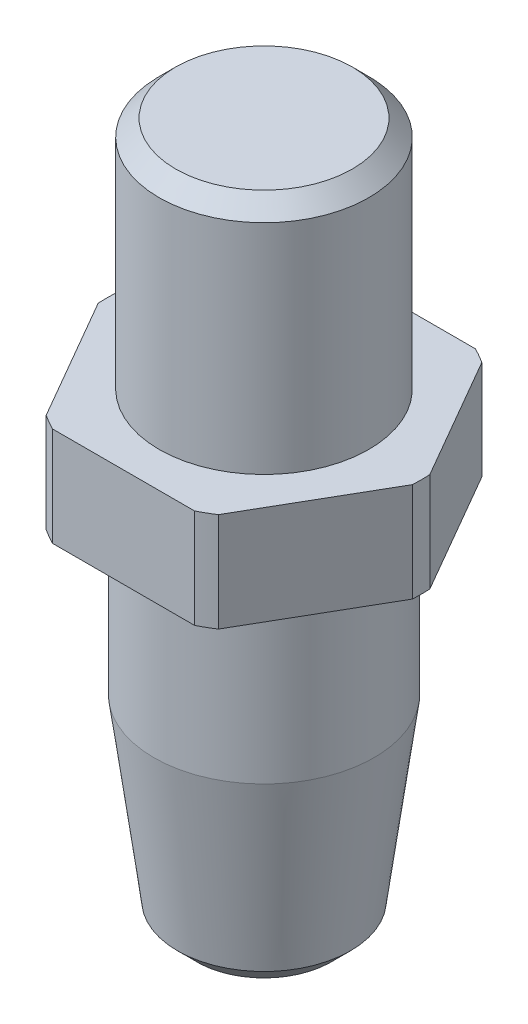
ISO-10303-21;
HEADER;
FILE_DESCRIPTION(('STEP AP214'),'2;1');
FILE_NAME('part.step','',(''),(''),'','','');
FILE_SCHEMA(('AUTOMOTIVE_DESIGN { 1 0 10303 214 1 1 1 1 }'));
ENDSEC;
DATA;
#1=APPLICATION_CONTEXT('core data for automotive mechanical design processes');
#2=APPLICATION_PROTOCOL_DEFINITION('international standard','automotive_design',2000,#1);
#3=PRODUCT_CONTEXT('',#1,'mechanical');
#4=PRODUCT('Part','Part','',(#3));
#5=PRODUCT_RELATED_PRODUCT_CATEGORY('part','',(#4));
#6=PRODUCT_DEFINITION_FORMATION('','',#4);
#7=PRODUCT_DEFINITION_CONTEXT('part definition',#1,'design');
#8=PRODUCT_DEFINITION('design','',#6,#7);
#9=PRODUCT_DEFINITION_SHAPE('','',#8);
#10=(LENGTH_UNIT() NAMED_UNIT(*) SI_UNIT(.MILLI.,.METRE.));
#11=(NAMED_UNIT(*) PLANE_ANGLE_UNIT() SI_UNIT($,.RADIAN.));
#12=(NAMED_UNIT(*) SI_UNIT($,.STERADIAN.) SOLID_ANGLE_UNIT());
#13=UNCERTAINTY_MEASURE_WITH_UNIT(LENGTH_MEASURE(1.E-05),#10,'distance_accuracy_value','');
#14=(GEOMETRIC_REPRESENTATION_CONTEXT(3) GLOBAL_UNCERTAINTY_ASSIGNED_CONTEXT((#13)) GLOBAL_UNIT_ASSIGNED_CONTEXT((#10,
#11,#12)) REPRESENTATION_CONTEXT('',''));
#15=CARTESIAN_POINT('',(0.,0.,0.));
#16=DIRECTION('',(0.,0.,1.));
#17=DIRECTION('',(1.,0.,0.));
#18=AXIS2_PLACEMENT_3D('',#15,#16,#17);
#19=CARTESIAN_POINT('',(1.04083408558608E-13,72.0465137761126,-2.84494650060196E-13));
#20=DIRECTION('',(0.,0.999999999999996,0.));
#21=DIRECTION('',(0.,0.,0.999999999999999));
#22=AXIS2_PLACEMENT_3D('',#19,#20,#21);
#23=CYLINDRICAL_SURFACE('',#22,9.52499999999999);
#24=DIRECTION('',(0.,0.999999999999996,0.));
#25=VECTOR('',#24,1.);
#26=CARTESIAN_POINT('',(5.21205185048389,72.0465137761126,7.9724613832784));
#27=LINE('',#26,#25);
#28=CARTESIAN_POINT('',(5.212051850484,5.99999999999967,7.97246138327829));
#29=VERTEX_POINT('',#28);
#30=CARTESIAN_POINT('',(5.21205185048395,-1.66533453693773E-13,7.97246138327839));
#31=VERTEX_POINT('',#30);
#32=EDGE_CURVE('E1266',#29,#31,#27,.F.);
#33=ORIENTED_EDGE('',*,*,#32,.F.);
#34=CARTESIAN_POINT('',(1.73472347597681E-13,5.99999999999989,-1.94289029309402E-13));
#35=DIRECTION('',(0.,0.999999999999996,0.));
#36=DIRECTION('',(0.,0.,0.999999999999999));
#37=AXIS2_PLACEMENT_3D('',#34,#35,#36);
#38=CIRCLE('',#37,9.52499999999999);
#39=CARTESIAN_POINT('',(4.29832816336783,5.99999999999951,8.49999999999972));
#40=VERTEX_POINT('',#39);
#41=EDGE_CURVE('E1242',#40,#29,#38,.T.);
#42=ORIENTED_EDGE('',*,*,#41,.F.);
#43=DIRECTION('',(0.,0.999999999999996,0.));
#44=VECTOR('',#43,1.);
#45=CARTESIAN_POINT('',(4.29832816336762,72.0465137761126,8.49999999999967));
#46=LINE('',#45,#44);
#47=CARTESIAN_POINT('',(4.29832816336762,-3.88578058618805E-13,8.49999999999985));
#48=VERTEX_POINT('',#47);
#49=EDGE_CURVE('E1227',#48,#40,#46,.T.);
#50=ORIENTED_EDGE('',*,*,#49,.F.);
#51=CARTESIAN_POINT('',(0.,0.,0.));
#52=DIRECTION('',(0.,0.999999999999996,0.));
#53=DIRECTION('',(0.,0.,0.999999999999999));
#54=AXIS2_PLACEMENT_3D('',#51,#52,#53);
#55=CIRCLE('',#54,9.52499999999999);
#56=EDGE_CURVE('E1240',#48,#31,#55,.T.);
#57=ORIENTED_EDGE('',*,*,#56,.T.);
#58=EDGE_LOOP('',(#33,#42,#50,#57));
#59=FACE_BOUND('',#58,.T.);
#60=ADVANCED_FACE('F1139',(#59),#23,.T.);
#61=DIRECTION('',(0.,0.999999999999996,0.));
#62=VECTOR('',#61,1.);
#63=CARTESIAN_POINT('',(9.51038001385176,72.0465137761124,0.527538616721245));
#64=LINE('',#63,#62);
#65=CARTESIAN_POINT('',(9.51038001385154,-4.44089209850063E-13,0.527538616721217));
#66=VERTEX_POINT('',#65);
#67=CARTESIAN_POINT('',(9.51038001385172,5.99999999999962,0.527538616721203));
#68=VERTEX_POINT('',#67);
#69=EDGE_CURVE('E1272',#66,#68,#64,.T.);
#70=ORIENTED_EDGE('',*,*,#69,.F.);
#71=CARTESIAN_POINT('',(9.51038001385156,0.,-0.527538616721772));
#72=VERTEX_POINT('',#71);
#73=EDGE_CURVE('E1250',#66,#72,#55,.T.);
#74=ORIENTED_EDGE('',*,*,#73,.T.);
#75=DIRECTION('',(0.,0.999999999999996,0.));
#76=VECTOR('',#75,1.);
#77=CARTESIAN_POINT('',(9.51038001385165,72.0465137761128,-0.527538616721716));
#78=LINE('',#77,#76);
#79=CARTESIAN_POINT('',(9.51038001385156,5.99999999999973,-0.527538616721709));
#80=VERTEX_POINT('',#79);
#81=EDGE_CURVE('E1274',#80,#72,#78,.F.);
#82=ORIENTED_EDGE('',*,*,#81,.F.);
#83=EDGE_CURVE('E1348',#68,#80,#38,.T.);
#84=ORIENTED_EDGE('',*,*,#83,.F.);
#85=EDGE_LOOP('',(#70,#74,#82,#84));
#86=FACE_BOUND('',#85,.T.);
#87=ADVANCED_FACE('F1388',(#86),#23,.T.);
#88=DIRECTION('',(0.,0.999999999999996,0.));
#89=VECTOR('',#88,1.);
#90=CARTESIAN_POINT('',(5.21205185048396,72.0465137761128,-7.97246138327878));
#91=LINE('',#90,#89);
#92=CARTESIAN_POINT('',(5.21205185048403,-3.33066907387547E-13,-7.97246138327878));
#93=VERTEX_POINT('',#92);
#94=CARTESIAN_POINT('',(5.21205185048385,5.99999999999984,-7.97246138327873));
#95=VERTEX_POINT('',#94);
#96=EDGE_CURVE('E1278',#93,#95,#91,.T.);
#97=ORIENTED_EDGE('',*,*,#96,.F.);
#98=CARTESIAN_POINT('',(4.29832816336778,-6.10622663543836E-13,-8.50000000000017));
#99=VERTEX_POINT('',#98);
#100=EDGE_CURVE('E1257',#93,#99,#55,.T.);
#101=ORIENTED_EDGE('',*,*,#100,.T.);
#102=DIRECTION('',(0.,0.999999999999996,0.));
#103=VECTOR('',#102,1.);
#104=CARTESIAN_POINT('',(4.29832816336782,72.0465137761129,-8.50000000000006));
#105=LINE('',#104,#103);
#106=CARTESIAN_POINT('',(4.29832816336775,5.99999999999951,-8.50000000000023));
#107=VERTEX_POINT('',#106);
#108=EDGE_CURVE('E1280',#107,#99,#105,.F.);
#109=ORIENTED_EDGE('',*,*,#108,.F.);
#110=EDGE_CURVE('E1335',#95,#107,#38,.T.);
#111=ORIENTED_EDGE('',*,*,#110,.F.);
#112=EDGE_LOOP('',(#97,#101,#109,#111));
#113=FACE_BOUND('',#112,.T.);
#114=ADVANCED_FACE('F1332',(#113),#23,.T.);
#115=DIRECTION('',(0.,0.999999999999996,0.));
#116=VECTOR('',#115,1.);
#117=CARTESIAN_POINT('',(-4.29832816336757,72.0465137761127,-8.50000000000026));
#118=LINE('',#117,#116);
#119=CARTESIAN_POINT('',(-4.29832816336766,-2.77555756156289E-13,-8.50000000000016));
#120=VERTEX_POINT('',#119);
#121=CARTESIAN_POINT('',(-4.29832816336758,5.99999999999923,-8.50000000000027));
#122=VERTEX_POINT('',#121);
#123=EDGE_CURVE('E1284',#120,#122,#118,.T.);
#124=ORIENTED_EDGE('',*,*,#123,.F.);
#125=CARTESIAN_POINT('',(-5.21205185048383,-4.9960036108132E-13,-7.97246138327866));
#126=VERTEX_POINT('',#125);
#127=EDGE_CURVE('E1264',#120,#126,#55,.T.);
#128=ORIENTED_EDGE('',*,*,#127,.T.);
#129=DIRECTION('',(0.,0.999999999999996,0.));
#130=VECTOR('',#129,1.);
#131=CARTESIAN_POINT('',(-5.21205185048389,72.0465137761125,-7.9724613832788));
#132=LINE('',#131,#130);
#133=CARTESIAN_POINT('',(-5.21205185048391,5.99999999999978,-7.9724613832788));
#134=VERTEX_POINT('',#133);
#135=EDGE_CURVE('E1286',#134,#126,#132,.F.);
#136=ORIENTED_EDGE('',*,*,#135,.F.);
#137=EDGE_CURVE('E1343',#122,#134,#38,.T.);
#138=ORIENTED_EDGE('',*,*,#137,.F.);
#139=EDGE_LOOP('',(#124,#128,#136,#138));
#140=FACE_BOUND('',#139,.T.);
#141=ADVANCED_FACE('F1340',(#140),#23,.T.);
#142=DIRECTION('',(0.,0.999999999999996,0.));
#143=VECTOR('',#142,1.);
#144=CARTESIAN_POINT('',(-9.51038001385167,72.0465137761126,-0.527538616721591));
#145=LINE('',#144,#143);
#146=CARTESIAN_POINT('',(-9.51038001385152,-2.22044604925031E-13,-0.527538616721626));
#147=VERTEX_POINT('',#146);
#148=CARTESIAN_POINT('',(-9.51038001385156,6.00000000000001,-0.527538616721716));
#149=VERTEX_POINT('',#148);
#150=EDGE_CURVE('E1290',#147,#149,#145,.T.);
#151=ORIENTED_EDGE('',*,*,#150,.F.);
#152=CARTESIAN_POINT('',(-9.51038001385154,-2.77555756156289E-13,0.527538616721508));
#153=VERTEX_POINT('',#152);
#154=EDGE_CURVE('E1259',#147,#153,#55,.T.);
#155=ORIENTED_EDGE('',*,*,#154,.T.);
#156=DIRECTION('',(0.,0.999999999999996,0.));
#157=VECTOR('',#156,1.);
#158=CARTESIAN_POINT('',(-9.51038001385131,72.0465137761126,0.527538616721286));
#159=LINE('',#158,#157);
#160=CARTESIAN_POINT('',(-9.51038001385153,5.99999999999978,0.527538616721335));
#161=VERTEX_POINT('',#160);
#162=EDGE_CURVE('E1162',#161,#153,#159,.F.);
#163=ORIENTED_EDGE('',*,*,#162,.F.);
#164=EDGE_CURVE('E1254',#149,#161,#38,.T.);
#165=ORIENTED_EDGE('',*,*,#164,.F.);
#166=EDGE_LOOP('',(#151,#155,#163,#165));
#167=FACE_BOUND('',#166,.T.);
#168=ADVANCED_FACE('F1311',(#167),#23,.T.);
#169=CARTESIAN_POINT('',(1.04083408558608E-13,72.0465137761126,-2.84494650060196E-13));
#170=DIRECTION('',(0.,0.999999999999996,0.));
#171=DIRECTION('',(0.,0.,0.999999999999999));
#172=AXIS2_PLACEMENT_3D('',#169,#170,#171);
#173=CYLINDRICAL_SURFACE('',#172,6.66749999999999);
#174=CARTESIAN_POINT('',(1.66533453693773E-13,-10.0000000000003,-2.56739074444567E-13));
#175=DIRECTION('',(0.,0.999999999999996,0.));
#176=DIRECTION('',(0.,0.,0.999999999999999));
#177=AXIS2_PLACEMENT_3D('',#174,#175,#176);
#178=CIRCLE('',#177,6.66749999999999);
#179=CARTESIAN_POINT('',(1.63942609487933E-13,-10.0000000000003,6.66749999999973));
#180=VERTEX_POINT('',#179);
#181=EDGE_CURVE('E1353',#180,#180,#178,.T.);
#182=ORIENTED_EDGE('',*,*,#181,.T.);
#183=EDGE_LOOP('',(#182));
#184=FACE_BOUND('',#183,.T.);
#185=CARTESIAN_POINT('',(0.,0.,0.));
#186=DIRECTION('',(0.,0.999999999999996,0.));
#187=DIRECTION('',(0.,0.,0.999999999999999));
#188=AXIS2_PLACEMENT_3D('',#185,#186,#187);
#189=CIRCLE('',#188,6.66749999999999);
#190=CARTESIAN_POINT('',(0.,0.,6.66749999999999));
#191=VERTEX_POINT('',#190);
#192=EDGE_CURVE('E1260',#191,#191,#189,.T.);
#193=ORIENTED_EDGE('',*,*,#192,.F.);
#194=EDGE_LOOP('',(#193));
#195=FACE_BOUND('',#194,.T.);
#196=ADVANCED_FACE('F1402',(#184,#195),#173,.T.);
#197=CARTESIAN_POINT('',(1.66533453693773E-13,-10.0000000000003,-2.56739074444567E-13));
#198=DIRECTION('',(0.,0.999999999999996,0.));
#199=DIRECTION('',(0.,0.,0.999999999999999));
#200=AXIS2_PLACEMENT_3D('',#197,#198,#199);
#201=CONICAL_SURFACE('',#200,6.66749999999999,0.131527921353512);
#202=CARTESIAN_POINT('',(0.,-20.8475390156062,-1.52655665885959E-13));
#203=DIRECTION('',(0.,-0.999999999999996,0.));
#204=DIRECTION('',(0.,0.,-0.999999999999999));
#205=AXIS2_PLACEMENT_3D('',#202,#203,#204);
#206=CIRCLE('',#205,5.23246098439375);
#207=CARTESIAN_POINT('',(0.,-20.8475390156062,-5.2324609843939));
#208=VERTEX_POINT('',#207);
#209=EDGE_CURVE('E1356',#208,#208,#206,.F.);
#210=ORIENTED_EDGE('',*,*,#209,.T.);
#211=EDGE_LOOP('',(#210));
#212=FACE_BOUND('',#211,.T.);
#213=ORIENTED_EDGE('',*,*,#181,.F.);
#214=EDGE_LOOP('',(#213));
#215=FACE_BOUND('',#214,.T.);
#216=ADVANCED_FACE('F1384',(#212,#215),#201,.T.);
#217=CARTESIAN_POINT('',(-5.07999999999995,-22.0000000000002,0.));
#218=DIRECTION('',(0.,-0.999999999999996,0.));
#219=DIRECTION('',(0.,0.,-0.999999999999999));
#220=AXIS2_PLACEMENT_3D('',#217,#218,#219);
#221=PLANE('',#220);
#222=CARTESIAN_POINT('',(1.31838984174237E-13,-21.9999999999999,-1.87350135405495E-13));
#223=DIRECTION('',(0.,-0.999999999999996,0.));
#224=DIRECTION('',(0.,0.,-0.999999999999999));
#225=AXIS2_PLACEMENT_3D('',#222,#223,#224);
#226=CIRCLE('',#225,4.07999999999998);
#227=CARTESIAN_POINT('',(1.33424382653402E-13,-21.9999999999999,-4.08000000000017));
#228=VERTEX_POINT('',#227);
#229=EDGE_CURVE('E1359',#228,#228,#226,.T.);
#230=ORIENTED_EDGE('',*,*,#229,.T.);
#231=EDGE_LOOP('',(#230));
#232=FACE_BOUND('',#231,.T.);
#233=ADVANCED_FACE('F1377',(#232),#221,.T.);
#234=CARTESIAN_POINT('',(-6.3500000000001,20.1999999999999,-2.08166817117217E-13));
#235=DIRECTION('',(0.,0.999999999999996,0.));
#236=DIRECTION('',(0.,0.,0.999999999999999));
#237=AXIS2_PLACEMENT_3D('',#234,#235,#236);
#238=PLANE('',#237);
#239=CARTESIAN_POINT('',(0.,20.1999999999994,-2.22044604925031E-13));
#240=DIRECTION('',(0.,0.999999999999996,0.));
#241=DIRECTION('',(0.,0.,0.999999999999999));
#242=AXIS2_PLACEMENT_3D('',#239,#240,#241);
#243=CIRCLE('',#242,5.34999999999998);
#244=CARTESIAN_POINT('',(0.,20.1999999999994,5.34999999999976));
#245=VERTEX_POINT('',#244);
#246=EDGE_CURVE('E1362',#245,#245,#243,.T.);
#247=ORIENTED_EDGE('',*,*,#246,.T.);
#248=EDGE_LOOP('',(#247));
#249=FACE_BOUND('',#248,.T.);
#250=ADVANCED_FACE('F1375',(#249),#238,.T.);
#251=CARTESIAN_POINT('',(1.04083408558608E-13,72.0465137761126,-2.84494650060196E-13));
#252=DIRECTION('',(0.,0.999999999999996,0.));
#253=DIRECTION('',(0.,0.,0.999999999999999));
#254=AXIS2_PLACEMENT_3D('',#251,#252,#253);
#255=CYLINDRICAL_SURFACE('',#254,6.34999999999999);
#256=CARTESIAN_POINT('',(0.,19.1999999999997,0.));
#257=DIRECTION('',(0.,0.999999999999996,0.));
#258=DIRECTION('',(0.,0.,0.999999999999999));
#259=AXIS2_PLACEMENT_3D('',#256,#257,#258);
#260=CIRCLE('',#259,6.34999999999999);
#261=CARTESIAN_POINT('',(0.,19.1999999999997,6.34999999999991));
#262=VERTEX_POINT('',#261);
#263=EDGE_CURVE('E1234',#262,#262,#260,.F.);
#264=ORIENTED_EDGE('',*,*,#263,.T.);
#265=EDGE_LOOP('',(#264));
#266=FACE_BOUND('',#265,.T.);
#267=CARTESIAN_POINT('',(1.73472347597681E-13,5.99999999999989,-1.94289029309402E-13));
#268=DIRECTION('',(0.,0.999999999999996,0.));
#269=DIRECTION('',(0.,0.,0.999999999999999));
#270=AXIS2_PLACEMENT_3D('',#267,#268,#269);
#271=CIRCLE('',#270,6.34999999999999);
#272=CARTESIAN_POINT('',(1.71004876925451E-13,5.99999999999989,6.34999999999979));
#273=VERTEX_POINT('',#272);
#274=EDGE_CURVE('E1350',#273,#273,#271,.T.);
#275=ORIENTED_EDGE('',*,*,#274,.T.);
#276=EDGE_LOOP('',(#275));
#277=FACE_BOUND('',#276,.T.);
#278=ADVANCED_FACE('F1367',(#266,#277),#255,.T.);
#279=CARTESIAN_POINT('',(-9.52499999999994,5.99999999999939,-2.22044604925031E-13));
#280=DIRECTION('',(0.,0.999999999999996,0.));
#281=DIRECTION('',(0.,0.,0.999999999999999));
#282=AXIS2_PLACEMENT_3D('',#279,#280,#281);
#283=PLANE('',#282);
#284=DIRECTION('',(-0.500000000000001,0.,0.866025403784439));
#285=VECTOR('',#284,1.);
#286=CARTESIAN_POINT('',(4.97996593216764,5.99999999999978,8.37444598552314));
#287=LINE('',#286,#285);
#288=EDGE_CURVE('E1268',#68,#29,#287,.T.);
#289=ORIENTED_EDGE('',*,*,#288,.F.);
#290=ORIENTED_EDGE('',*,*,#83,.T.);
#291=DIRECTION('',(0.500000000000001,0.,0.866025403784438));
#292=VECTOR('',#291,1.);
#293=CARTESIAN_POINT('',(4.97996593216767,5.99999999999973,-8.37444598552357));
#294=LINE('',#293,#292);
#295=EDGE_CURVE('E1276',#95,#80,#294,.T.);
#296=ORIENTED_EDGE('',*,*,#295,.F.);
#297=ORIENTED_EDGE('',*,*,#110,.T.);
#298=DIRECTION('',(1.,0.,0.));
#299=VECTOR('',#298,1.);
#300=CARTESIAN_POINT('',(-9.52499999999988,5.99999999999984,-8.50000000000023));
#301=LINE('',#300,#299);
#302=EDGE_CURVE('E1282',#122,#107,#301,.T.);
#303=ORIENTED_EDGE('',*,*,#302,.F.);
#304=ORIENTED_EDGE('',*,*,#137,.T.);
#305=DIRECTION('',(0.500000000000001,0.,-0.866025403784439));
#306=VECTOR('',#305,1.);
#307=CARTESIAN_POINT('',(-9.74246593216775,5.99999999999962,-0.125554014476802));
#308=LINE('',#307,#306);
#309=EDGE_CURVE('E1288',#149,#134,#308,.T.);
#310=ORIENTED_EDGE('',*,*,#309,.F.);
#311=ORIENTED_EDGE('',*,*,#164,.T.);
#312=DIRECTION('',(-0.5,0.,-0.866025403784438));
#313=VECTOR('',#312,1.);
#314=CARTESIAN_POINT('',(-9.74246593216776,5.99999999999962,0.12555401447651));
#315=LINE('',#314,#313);
#316=CARTESIAN_POINT('',(-5.21205185048376,5.99999999999984,7.97246138327826));
#317=VERTEX_POINT('',#316);
#318=EDGE_CURVE('E1293',#317,#161,#315,.T.);
#319=ORIENTED_EDGE('',*,*,#318,.F.);
#320=CARTESIAN_POINT('',(-4.29832816336761,5.99999999999962,8.49999999999988));
#321=VERTEX_POINT('',#320);
#322=EDGE_CURVE('E1249',#317,#321,#38,.T.);
#323=ORIENTED_EDGE('',*,*,#322,.T.);
#324=DIRECTION('',(-1.,0.,0.));
#325=VECTOR('',#324,1.);
#326=CARTESIAN_POINT('',(-9.52499999999994,5.99999999999973,8.49999999999985));
#327=LINE('',#326,#325);
#328=EDGE_CURVE('E1243',#40,#321,#327,.T.);
#329=ORIENTED_EDGE('',*,*,#328,.F.);
#330=ORIENTED_EDGE('',*,*,#41,.T.);
#331=EDGE_LOOP('',(#289,#290,#296,#297,#303,#304,#310,#311,#319,#323,#329,#330));
#332=FACE_BOUND('',#331,.T.);
#333=ORIENTED_EDGE('',*,*,#274,.F.);
#334=EDGE_LOOP('',(#333));
#335=FACE_BOUND('',#334,.T.);
#336=ADVANCED_FACE('F1303',(#332,#335),#283,.T.);
#337=DIRECTION('',(0.,0.999999999999996,0.));
#338=VECTOR('',#337,1.);
#339=CARTESIAN_POINT('',(-5.21205185048374,72.0465137761126,7.97246138327821));
#340=LINE('',#339,#338);
#341=CARTESIAN_POINT('',(-5.21205185048374,2.22044604925031E-13,7.97246138327835));
#342=VERTEX_POINT('',#341);
#343=EDGE_CURVE('E1295',#342,#317,#340,.T.);
#344=ORIENTED_EDGE('',*,*,#343,.F.);
#345=CARTESIAN_POINT('',(-4.29832816336749,-3.88578058618805E-13,8.4999999999998));
#346=VERTEX_POINT('',#345);
#347=EDGE_CURVE('E1252',#342,#346,#55,.T.);
#348=ORIENTED_EDGE('',*,*,#347,.T.);
#349=DIRECTION('',(0.,0.999999999999996,0.));
#350=VECTOR('',#349,1.);
#351=CARTESIAN_POINT('',(-4.29832816336764,72.0465137761128,8.49999999999982));
#352=LINE('',#351,#350);
#353=EDGE_CURVE('E1154',#321,#346,#352,.F.);
#354=ORIENTED_EDGE('',*,*,#353,.F.);
#355=ORIENTED_EDGE('',*,*,#322,.F.);
#356=EDGE_LOOP('',(#344,#348,#354,#355));
#357=FACE_BOUND('',#356,.T.);
#358=ADVANCED_FACE('F1300',(#357),#23,.T.);
#359=CARTESIAN_POINT('',(-6.66749999999998,-1.66533453693773E-13,-2.15105711021124E-13));
#360=DIRECTION('',(0.,-0.999999999999996,0.));
#361=DIRECTION('',(0.,0.,-0.999999999999999));
#362=AXIS2_PLACEMENT_3D('',#359,#360,#361);
#363=PLANE('',#362);
#364=DIRECTION('',(0.500000000000001,0.,-0.866025403784439));
#365=VECTOR('',#364,1.);
#366=CARTESIAN_POINT('',(5.6943409321679,-1.11022302462516E-13,7.1371121898661));
#367=LINE('',#366,#365);
#368=EDGE_CURVE('E13',#31,#66,#367,.T.);
#369=ORIENTED_EDGE('',*,*,#368,.F.);
#370=ORIENTED_EDGE('',*,*,#56,.F.);
#371=DIRECTION('',(1.,0.,0.));
#372=VECTOR('',#371,1.);
#373=CARTESIAN_POINT('',(-6.6674999999999,-3.88578058618805E-13,8.49999999999976));
#374=LINE('',#373,#372);
#375=EDGE_CURVE('E1224',#346,#48,#374,.T.);
#376=ORIENTED_EDGE('',*,*,#375,.F.);
#377=ORIENTED_EDGE('',*,*,#347,.F.);
#378=DIRECTION('',(0.5,0.,0.866025403784438));
#379=VECTOR('',#378,1.);
#380=CARTESIAN_POINT('',(-9.02809093216759,-4.44089209850063E-13,1.36288781013331));
#381=LINE('',#380,#379);
#382=EDGE_CURVE('E1233',#153,#342,#381,.T.);
#383=ORIENTED_EDGE('',*,*,#382,.F.);
#384=ORIENTED_EDGE('',*,*,#154,.F.);
#385=DIRECTION('',(-0.500000000000001,0.,0.866025403784439));
#386=VECTOR('',#385,1.);
#387=CARTESIAN_POINT('',(-9.02809093216766,-1.66533453693773E-13,-1.36288781013372));
#388=LINE('',#387,#386);
#389=EDGE_CURVE('E1315',#126,#147,#388,.T.);
#390=ORIENTED_EDGE('',*,*,#389,.F.);
#391=ORIENTED_EDGE('',*,*,#127,.F.);
#392=DIRECTION('',(-1.,0.,0.));
#393=VECTOR('',#392,1.);
#394=CARTESIAN_POINT('',(-6.66750000000005,-3.88578058618805E-13,-8.5000000000002));
#395=LINE('',#394,#393);
#396=EDGE_CURVE('E1318',#99,#120,#395,.T.);
#397=ORIENTED_EDGE('',*,*,#396,.F.);
#398=ORIENTED_EDGE('',*,*,#100,.F.);
#399=DIRECTION('',(-0.500000000000001,0.,-0.866025403784438));
#400=VECTOR('',#399,1.);
#401=CARTESIAN_POINT('',(5.69434093216777,-2.22044604925031E-13,-7.13711218986653));
#402=LINE('',#401,#400);
#403=EDGE_CURVE('E1147',#72,#93,#402,.T.);
#404=ORIENTED_EDGE('',*,*,#403,.F.);
#405=ORIENTED_EDGE('',*,*,#73,.F.);
#406=EDGE_LOOP('',(#369,#370,#376,#377,#383,#384,#390,#391,#397,#398,#404,#405));
#407=FACE_BOUND('',#406,.T.);
#408=ORIENTED_EDGE('',*,*,#192,.T.);
#409=EDGE_LOOP('',(#408));
#410=FACE_BOUND('',#409,.T.);
#411=ADVANCED_FACE('F1246',(#407,#410),#363,.T.);
#412=CARTESIAN_POINT('',(0.,-20.8475390156062,-1.52655665885959E-13));
#413=DIRECTION('',(0.,0.999999999999996,0.));
#414=DIRECTION('',(0.,0.,0.999999999999999));
#415=AXIS2_PLACEMENT_3D('',#412,#413,#414);
#416=CONICAL_SURFACE('',#415,5.23246098439375,0.78539816339745);
#417=ORIENTED_EDGE('',*,*,#229,.F.);
#418=EDGE_LOOP('',(#417));
#419=FACE_BOUND('',#418,.T.);
#420=ORIENTED_EDGE('',*,*,#209,.F.);
#421=EDGE_LOOP('',(#420));
#422=FACE_BOUND('',#421,.T.);
#423=ADVANCED_FACE('F1372',(#419,#422),#416,.T.);
#424=CARTESIAN_POINT('',(0.,20.1999999999994,-2.22044604925031E-13));
#425=DIRECTION('',(0.,-0.999999999999996,0.));
#426=DIRECTION('',(0.,0.,-0.999999999999999));
#427=AXIS2_PLACEMENT_3D('',#424,#425,#426);
#428=CONICAL_SURFACE('',#427,5.34999999999999,0.785398163397444);
#429=ORIENTED_EDGE('',*,*,#263,.F.);
#430=EDGE_LOOP('',(#429));
#431=FACE_BOUND('',#430,.T.);
#432=ORIENTED_EDGE('',*,*,#246,.F.);
#433=EDGE_LOOP('',(#432));
#434=FACE_BOUND('',#433,.T.);
#435=ADVANCED_FACE('F1141',(#431,#434),#428,.T.);
#436=CARTESIAN_POINT('',(-4.90747728811165,20.1999999999998,8.49999999999999));
#437=DIRECTION('',(0.,0.,-0.999999999999999));
#438=DIRECTION('',(-1.,0.,0.));
#439=AXIS2_PLACEMENT_3D('',#436,#437,#438);
#440=PLANE('',#439);
#441=ORIENTED_EDGE('',*,*,#353,.T.);
#442=ORIENTED_EDGE('',*,*,#375,.T.);
#443=ORIENTED_EDGE('',*,*,#49,.T.);
#444=ORIENTED_EDGE('',*,*,#328,.T.);
#445=EDGE_LOOP('',(#441,#442,#443,#444));
#446=FACE_BOUND('',#445,.T.);
#447=ADVANCED_FACE('F1226',(#446),#440,.F.);
#448=CARTESIAN_POINT('',(-9.8149545762237,20.1999999999999,-1.17961196366423E-13));
#449=DIRECTION('',(0.866025403784439,0.,-0.5));
#450=DIRECTION('',(-0.5,0.,-0.866025403784438));
#451=AXIS2_PLACEMENT_3D('',#448,#449,#450);
#452=PLANE('',#451);
#453=ORIENTED_EDGE('',*,*,#162,.T.);
#454=ORIENTED_EDGE('',*,*,#382,.T.);
#455=ORIENTED_EDGE('',*,*,#343,.T.);
#456=ORIENTED_EDGE('',*,*,#318,.T.);
#457=EDGE_LOOP('',(#453,#454,#455,#456));
#458=FACE_BOUND('',#457,.T.);
#459=ADVANCED_FACE('F1308',(#458),#452,.F.);
#460=CARTESIAN_POINT('',(-4.90747728811176,20.2,-8.5000000000001));
#461=DIRECTION('',(0.86602540378444,0.,0.500000000000001));
#462=DIRECTION('',(0.500000000000001,0.,-0.866025403784439));
#463=AXIS2_PLACEMENT_3D('',#460,#461,#462);
#464=PLANE('',#463);
#465=ORIENTED_EDGE('',*,*,#135,.T.);
#466=ORIENTED_EDGE('',*,*,#389,.T.);
#467=ORIENTED_EDGE('',*,*,#150,.T.);
#468=ORIENTED_EDGE('',*,*,#309,.T.);
#469=EDGE_LOOP('',(#465,#466,#467,#468));
#470=FACE_BOUND('',#469,.T.);
#471=ADVANCED_FACE('F1440',(#470),#464,.F.);
#472=CARTESIAN_POINT('',(4.90747728811188,20.1999999999994,-8.5000000000003));
#473=DIRECTION('',(0.,0.,0.999999999999999));
#474=DIRECTION('',(1.,0.,0.));
#475=AXIS2_PLACEMENT_3D('',#472,#473,#474);
#476=PLANE('',#475);
#477=ORIENTED_EDGE('',*,*,#108,.T.);
#478=ORIENTED_EDGE('',*,*,#396,.T.);
#479=ORIENTED_EDGE('',*,*,#123,.T.);
#480=ORIENTED_EDGE('',*,*,#302,.T.);
#481=EDGE_LOOP('',(#477,#478,#479,#480));
#482=FACE_BOUND('',#481,.T.);
#483=ADVANCED_FACE('F1346',(#482),#476,.F.);
#484=CARTESIAN_POINT('',(9.81495457622377,20.2000000000001,0.));
#485=DIRECTION('',(-0.866025403784439,0.,0.5));
#486=DIRECTION('',(0.500000000000001,0.,0.866025403784438));
#487=AXIS2_PLACEMENT_3D('',#484,#485,#486);
#488=PLANE('',#487);
#489=ORIENTED_EDGE('',*,*,#81,.T.);
#490=ORIENTED_EDGE('',*,*,#403,.T.);
#491=ORIENTED_EDGE('',*,*,#96,.T.);
#492=ORIENTED_EDGE('',*,*,#295,.T.);
#493=EDGE_LOOP('',(#489,#490,#491,#492));
#494=FACE_BOUND('',#493,.T.);
#495=ADVANCED_FACE('F1325',(#494),#488,.F.);
#496=CARTESIAN_POINT('',(4.90747728811188,20.1999999999997,8.49999999999988));
#497=DIRECTION('',(-0.866025403784439,0.,-0.499999999999999));
#498=DIRECTION('',(-0.500000000000001,0.,0.866025403784439));
#499=AXIS2_PLACEMENT_3D('',#496,#497,#498);
#500=PLANE('',#499);
#501=ORIENTED_EDGE('',*,*,#32,.T.);
#502=ORIENTED_EDGE('',*,*,#368,.T.);
#503=ORIENTED_EDGE('',*,*,#69,.T.);
#504=ORIENTED_EDGE('',*,*,#288,.T.);
#505=EDGE_LOOP('',(#501,#502,#503,#504));
#506=FACE_BOUND('',#505,.T.);
#507=ADVANCED_FACE('F1463',(#506),#500,.F.);
#508=CLOSED_SHELL('',(#60,#87,#114,#141,#168,#196,#216,#233,#250,#278,#336,#358,#411,#423,#435,
#447,#459,#471,#483,#495,#507));
#509=MANIFOLD_SOLID_BREP('B2',#508);
#510=ADVANCED_BREP_SHAPE_REPRESENTATION('',(#18,#509),#14);
#511=SHAPE_DEFINITION_REPRESENTATION(#9,#510);
ENDSEC;
END-ISO-10303-21;
